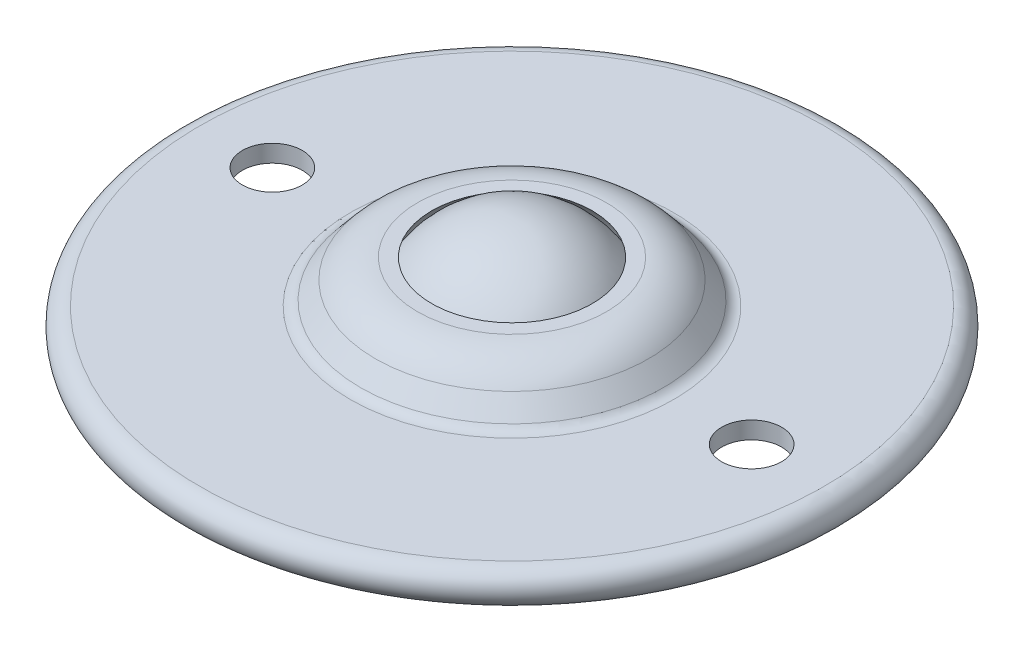
ISO-10303-21;
HEADER;
FILE_DESCRIPTION(('STEP AP214'),'2;1');
FILE_NAME('part.step','',(''),(''),'','','');
FILE_SCHEMA(('AUTOMOTIVE_DESIGN { 1 0 10303 214 1 1 1 1 }'));
ENDSEC;
DATA;
#1=APPLICATION_CONTEXT('core data for automotive mechanical design processes');
#2=APPLICATION_PROTOCOL_DEFINITION('international standard','automotive_design',2000,#1);
#3=PRODUCT_CONTEXT('',#1,'mechanical');
#4=PRODUCT('Part','Part','',(#3));
#5=PRODUCT_RELATED_PRODUCT_CATEGORY('part','',(#4));
#6=PRODUCT_DEFINITION_FORMATION('','',#4);
#7=PRODUCT_DEFINITION_CONTEXT('part definition',#1,'design');
#8=PRODUCT_DEFINITION('design','',#6,#7);
#9=PRODUCT_DEFINITION_SHAPE('','',#8);
#10=(LENGTH_UNIT() NAMED_UNIT(*) SI_UNIT(.MILLI.,.METRE.));
#11=(NAMED_UNIT(*) PLANE_ANGLE_UNIT() SI_UNIT($,.RADIAN.));
#12=(NAMED_UNIT(*) SI_UNIT($,.STERADIAN.) SOLID_ANGLE_UNIT());
#13=UNCERTAINTY_MEASURE_WITH_UNIT(LENGTH_MEASURE(1.E-05),#10,'distance_accuracy_value','');
#14=(GEOMETRIC_REPRESENTATION_CONTEXT(3) GLOBAL_UNCERTAINTY_ASSIGNED_CONTEXT((#13)) GLOBAL_UNIT_ASSIGNED_CONTEXT((#10,
#11,#12)) REPRESENTATION_CONTEXT('',''));
#15=CARTESIAN_POINT('',(0.,0.,0.));
#16=DIRECTION('',(0.,0.,1.));
#17=DIRECTION('',(1.,0.,0.));
#18=AXIS2_PLACEMENT_3D('',#15,#16,#17);
#19=CARTESIAN_POINT('',(0.,0.,0.));
#20=DIRECTION('',(0.,1.,0.));
#21=DIRECTION('',(-1.,0.,0.));
#22=AXIS2_PLACEMENT_3D('',#19,#20,#21);
#23=SPHERICAL_SURFACE('',#22,9.525);
#24=CARTESIAN_POINT('',(0.,9.525,0.));
#25=VERTEX_POINT('',#24);
#26=VERTEX_LOOP('',#25);
#27=FACE_BOUND('',#26,.T.);
#28=ADVANCED_FACE('F45',(#27),#23,.T.);
#29=CLOSED_SHELL('',(#28));
#30=MANIFOLD_SOLID_BREP('B2',#29);
#31=CARTESIAN_POINT('',(-22.225,-12.7,0.));
#32=DIRECTION('',(0.,1.,0.));
#33=DIRECTION('',(0.,0.,1.));
#34=AXIS2_PLACEMENT_3D('',#31,#32,#33);
#35=CYLINDRICAL_SURFACE('',#34,2.778125);
#36=CARTESIAN_POINT('',(-22.225,2.40625,0.));
#37=DIRECTION('',(0.,1.,0.));
#38=DIRECTION('',(0.,0.,1.));
#39=AXIS2_PLACEMENT_3D('',#36,#37,#38);
#40=CIRCLE('',#39,2.778125);
#41=CARTESIAN_POINT('',(-22.225,2.40625,2.778125));
#42=VERTEX_POINT('',#41);
#43=EDGE_CURVE('E93',#42,#42,#40,.T.);
#44=CARTESIAN_POINT('',(-22.225,0.80625,0.));
#45=DIRECTION('',(0.,-1.,0.));
#46=DIRECTION('',(0.,0.,-1.));
#47=AXIS2_PLACEMENT_3D('',#44,#45,#46);
#48=CIRCLE('',#47,2.778125);
#49=CARTESIAN_POINT('',(-22.225,0.80625,2.778125));
#50=VERTEX_POINT('',#49);
#51=EDGE_CURVE('E86',#50,#50,#48,.F.);
#52=CARTESIAN_POINT('',(-22.225,2.40625,2.778125));
#53=CARTESIAN_POINT('',(-22.225,2.38958333333333,2.778125));
#54=CARTESIAN_POINT('',(-22.225,2.37291666666667,2.778125));
#55=CARTESIAN_POINT('',(-22.225,2.33958333333333,2.778125));
#56=CARTESIAN_POINT('',(-22.225,2.32291666666667,2.778125));
#57=CARTESIAN_POINT('',(-22.225,2.28958333333333,2.778125));
#58=CARTESIAN_POINT('',(-22.225,2.27291666666667,2.778125));
#59=CARTESIAN_POINT('',(-22.225,2.23958333333333,2.778125));
#60=CARTESIAN_POINT('',(-22.225,2.22291666666667,2.778125));
#61=CARTESIAN_POINT('',(-22.225,2.18958333333333,2.778125));
#62=CARTESIAN_POINT('',(-22.225,2.17291666666667,2.778125));
#63=CARTESIAN_POINT('',(-22.225,2.13958333333333,2.778125));
#64=CARTESIAN_POINT('',(-22.225,2.12291666666667,2.778125));
#65=CARTESIAN_POINT('',(-22.225,2.08958333333333,2.778125));
#66=CARTESIAN_POINT('',(-22.225,2.07291666666667,2.778125));
#67=CARTESIAN_POINT('',(-22.225,2.03958333333333,2.778125));
#68=CARTESIAN_POINT('',(-22.225,2.02291666666667,2.778125));
#69=CARTESIAN_POINT('',(-22.225,1.98958333333333,2.778125));
#70=CARTESIAN_POINT('',(-22.225,1.97291666666667,2.778125));
#71=CARTESIAN_POINT('',(-22.225,1.93958333333333,2.778125));
#72=CARTESIAN_POINT('',(-22.225,1.92291666666667,2.778125));
#73=CARTESIAN_POINT('',(-22.225,1.88958333333333,2.778125));
#74=CARTESIAN_POINT('',(-22.225,1.87291666666667,2.778125));
#75=CARTESIAN_POINT('',(-22.225,1.83958333333333,2.778125));
#76=CARTESIAN_POINT('',(-22.225,1.82291666666667,2.778125));
#77=CARTESIAN_POINT('',(-22.225,1.78958333333333,2.778125));
#78=CARTESIAN_POINT('',(-22.225,1.77291666666667,2.778125));
#79=CARTESIAN_POINT('',(-22.225,1.73958333333333,2.778125));
#80=CARTESIAN_POINT('',(-22.225,1.72291666666667,2.778125));
#81=CARTESIAN_POINT('',(-22.225,1.68958333333333,2.778125));
#82=CARTESIAN_POINT('',(-22.225,1.67291666666667,2.778125));
#83=CARTESIAN_POINT('',(-22.225,1.63958333333333,2.778125));
#84=CARTESIAN_POINT('',(-22.225,1.62291666666667,2.778125));
#85=CARTESIAN_POINT('',(-22.225,1.58958333333333,2.778125));
#86=CARTESIAN_POINT('',(-22.225,1.57291666666667,2.778125));
#87=CARTESIAN_POINT('',(-22.225,1.53958333333333,2.778125));
#88=CARTESIAN_POINT('',(-22.225,1.52291666666667,2.778125));
#89=CARTESIAN_POINT('',(-22.225,1.48958333333333,2.778125));
#90=CARTESIAN_POINT('',(-22.225,1.47291666666667,2.778125));
#91=CARTESIAN_POINT('',(-22.225,1.43958333333333,2.778125));
#92=CARTESIAN_POINT('',(-22.225,1.42291666666667,2.778125));
#93=CARTESIAN_POINT('',(-22.225,1.38958333333333,2.778125));
#94=CARTESIAN_POINT('',(-22.225,1.37291666666667,2.778125));
#95=CARTESIAN_POINT('',(-22.225,1.33958333333333,2.778125));
#96=CARTESIAN_POINT('',(-22.225,1.32291666666667,2.778125));
#97=CARTESIAN_POINT('',(-22.225,1.28958333333333,2.778125));
#98=CARTESIAN_POINT('',(-22.225,1.27291666666667,2.778125));
#99=CARTESIAN_POINT('',(-22.225,1.23958333333333,2.778125));
#100=CARTESIAN_POINT('',(-22.225,1.22291666666667,2.778125));
#101=CARTESIAN_POINT('',(-22.225,1.18958333333333,2.778125));
#102=CARTESIAN_POINT('',(-22.225,1.17291666666667,2.778125));
#103=CARTESIAN_POINT('',(-22.225,1.13958333333333,2.778125));
#104=CARTESIAN_POINT('',(-22.225,1.12291666666667,2.778125));
#105=CARTESIAN_POINT('',(-22.225,1.08958333333333,2.778125));
#106=CARTESIAN_POINT('',(-22.225,1.07291666666667,2.778125));
#107=CARTESIAN_POINT('',(-22.225,1.03958333333333,2.778125));
#108=CARTESIAN_POINT('',(-22.225,1.02291666666667,2.778125));
#109=CARTESIAN_POINT('',(-22.225,0.989583333333334,2.778125));
#110=CARTESIAN_POINT('',(-22.225,0.972916666666667,2.778125));
#111=CARTESIAN_POINT('',(-22.225,0.939583333333333,2.778125));
#112=CARTESIAN_POINT('',(-22.225,0.922916666666666,2.778125));
#113=CARTESIAN_POINT('',(-22.225,0.889583333333333,2.778125));
#114=CARTESIAN_POINT('',(-22.225,0.872916666666666,2.778125));
#115=CARTESIAN_POINT('',(-22.225,0.839583333333333,2.778125));
#116=CARTESIAN_POINT('',(-22.225,0.822916666666666,2.778125));
#117=CARTESIAN_POINT('',(-22.225,0.80625,2.778125));
#118=B_SPLINE_CURVE_WITH_KNOTS('',3,(#52,#53,#54,#55,#56,#57,#58,#59,#60,#61,#62,#63,#64,#65,
#66,#67,#68,#69,#70,#71,#72,#73,#74,#75,#76,#77,#78,#79,#80,#81,#82,#83,#84,#85,#86,#87,#88,#89,
#90,#91,#92,#93,#94,#95,#96,#97,#98,#99,#100,#101,#102,#103,#104,#105,#106,#107,#108,#109,#110,
#111,#112,#113,#114,#115,#116,#117),.UNSPECIFIED.,.F.,.F.,(4,2,2,2,2,2,2,2,2,2,2,2,2,2,2,2,2,2,
2,2,2,2,2,2,2,2,2,2,2,2,2,2,4),(0.,0.0499999999999997,0.0999999999999994,0.150000000000001,
0.200000000000001,0.25,0.3,0.35,0.400000000000001,0.450000000000001,0.5,0.55,0.6,0.65,
0.700000000000001,0.750000000000001,0.8,0.85,0.9,0.950000000000001,1.,1.05,1.1,1.15,1.2,1.25,
1.3,1.35,1.4,1.45,1.5,1.55,1.6),.UNSPECIFIED.);
#119=EDGE_CURVE('BSEAM56',#42,#50,#118,.T.);
#120=ORIENTED_EDGE('',*,*,#43,.T.);
#121=ORIENTED_EDGE('',*,*,#51,.F.);
#122=ORIENTED_EDGE('',*,*,#119,.T.);
#123=ORIENTED_EDGE('',*,*,#119,.F.);
#124=EDGE_LOOP('',(#120,#122,#121,#123));
#125=FACE_BOUND('',#124,.T.);
#126=ADVANCED_FACE('F56',(#125),#35,.F.);
#127=CARTESIAN_POINT('',(22.225,-12.7,0.));
#128=DIRECTION('',(0.,1.,0.));
#129=DIRECTION('',(0.,0.,1.));
#130=AXIS2_PLACEMENT_3D('',#127,#128,#129);
#131=CYLINDRICAL_SURFACE('',#130,2.778125);
#132=CARTESIAN_POINT('',(22.225,2.40625,0.));
#133=DIRECTION('',(0.,1.,0.));
#134=DIRECTION('',(0.,0.,1.));
#135=AXIS2_PLACEMENT_3D('',#132,#133,#134);
#136=CIRCLE('',#135,2.778125);
#137=CARTESIAN_POINT('',(22.225,2.40625,2.778125));
#138=VERTEX_POINT('',#137);
#139=EDGE_CURVE('E96',#138,#138,#136,.T.);
#140=CARTESIAN_POINT('',(22.225,0.80625,0.));
#141=DIRECTION('',(0.,-1.,0.));
#142=DIRECTION('',(0.,0.,-1.));
#143=AXIS2_PLACEMENT_3D('',#140,#141,#142);
#144=CIRCLE('',#143,2.778125);
#145=CARTESIAN_POINT('',(22.225,0.80625,2.778125));
#146=VERTEX_POINT('',#145);
#147=EDGE_CURVE('E83',#146,#146,#144,.F.);
#148=CARTESIAN_POINT('',(22.225,2.40625,2.778125));
#149=CARTESIAN_POINT('',(22.225,2.38958333333333,2.778125));
#150=CARTESIAN_POINT('',(22.225,2.37291666666667,2.778125));
#151=CARTESIAN_POINT('',(22.225,2.33958333333333,2.778125));
#152=CARTESIAN_POINT('',(22.225,2.32291666666667,2.778125));
#153=CARTESIAN_POINT('',(22.225,2.28958333333333,2.778125));
#154=CARTESIAN_POINT('',(22.225,2.27291666666667,2.778125));
#155=CARTESIAN_POINT('',(22.225,2.23958333333333,2.778125));
#156=CARTESIAN_POINT('',(22.225,2.22291666666667,2.778125));
#157=CARTESIAN_POINT('',(22.225,2.18958333333333,2.778125));
#158=CARTESIAN_POINT('',(22.225,2.17291666666667,2.778125));
#159=CARTESIAN_POINT('',(22.225,2.13958333333333,2.778125));
#160=CARTESIAN_POINT('',(22.225,2.12291666666667,2.778125));
#161=CARTESIAN_POINT('',(22.225,2.08958333333333,2.778125));
#162=CARTESIAN_POINT('',(22.225,2.07291666666667,2.778125));
#163=CARTESIAN_POINT('',(22.225,2.03958333333333,2.778125));
#164=CARTESIAN_POINT('',(22.225,2.02291666666667,2.778125));
#165=CARTESIAN_POINT('',(22.225,1.98958333333333,2.778125));
#166=CARTESIAN_POINT('',(22.225,1.97291666666667,2.778125));
#167=CARTESIAN_POINT('',(22.225,1.93958333333333,2.778125));
#168=CARTESIAN_POINT('',(22.225,1.92291666666667,2.778125));
#169=CARTESIAN_POINT('',(22.225,1.88958333333333,2.778125));
#170=CARTESIAN_POINT('',(22.225,1.87291666666667,2.778125));
#171=CARTESIAN_POINT('',(22.225,1.83958333333333,2.778125));
#172=CARTESIAN_POINT('',(22.225,1.82291666666667,2.778125));
#173=CARTESIAN_POINT('',(22.225,1.78958333333333,2.778125));
#174=CARTESIAN_POINT('',(22.225,1.77291666666667,2.778125));
#175=CARTESIAN_POINT('',(22.225,1.73958333333333,2.778125));
#176=CARTESIAN_POINT('',(22.225,1.72291666666667,2.778125));
#177=CARTESIAN_POINT('',(22.225,1.68958333333333,2.778125));
#178=CARTESIAN_POINT('',(22.225,1.67291666666667,2.778125));
#179=CARTESIAN_POINT('',(22.225,1.63958333333333,2.778125));
#180=CARTESIAN_POINT('',(22.225,1.62291666666667,2.778125));
#181=CARTESIAN_POINT('',(22.225,1.58958333333333,2.778125));
#182=CARTESIAN_POINT('',(22.225,1.57291666666667,2.778125));
#183=CARTESIAN_POINT('',(22.225,1.53958333333333,2.778125));
#184=CARTESIAN_POINT('',(22.225,1.52291666666667,2.778125));
#185=CARTESIAN_POINT('',(22.225,1.48958333333333,2.778125));
#186=CARTESIAN_POINT('',(22.225,1.47291666666667,2.778125));
#187=CARTESIAN_POINT('',(22.225,1.43958333333333,2.778125));
#188=CARTESIAN_POINT('',(22.225,1.42291666666667,2.778125));
#189=CARTESIAN_POINT('',(22.225,1.38958333333333,2.778125));
#190=CARTESIAN_POINT('',(22.225,1.37291666666667,2.778125));
#191=CARTESIAN_POINT('',(22.225,1.33958333333333,2.778125));
#192=CARTESIAN_POINT('',(22.225,1.32291666666667,2.778125));
#193=CARTESIAN_POINT('',(22.225,1.28958333333333,2.778125));
#194=CARTESIAN_POINT('',(22.225,1.27291666666667,2.778125));
#195=CARTESIAN_POINT('',(22.225,1.23958333333333,2.778125));
#196=CARTESIAN_POINT('',(22.225,1.22291666666667,2.778125));
#197=CARTESIAN_POINT('',(22.225,1.18958333333333,2.778125));
#198=CARTESIAN_POINT('',(22.225,1.17291666666667,2.778125));
#199=CARTESIAN_POINT('',(22.225,1.13958333333333,2.778125));
#200=CARTESIAN_POINT('',(22.225,1.12291666666667,2.778125));
#201=CARTESIAN_POINT('',(22.225,1.08958333333333,2.778125));
#202=CARTESIAN_POINT('',(22.225,1.07291666666667,2.778125));
#203=CARTESIAN_POINT('',(22.225,1.03958333333333,2.778125));
#204=CARTESIAN_POINT('',(22.225,1.02291666666667,2.778125));
#205=CARTESIAN_POINT('',(22.225,0.989583333333334,2.778125));
#206=CARTESIAN_POINT('',(22.225,0.972916666666667,2.778125));
#207=CARTESIAN_POINT('',(22.225,0.939583333333333,2.778125));
#208=CARTESIAN_POINT('',(22.225,0.922916666666666,2.778125));
#209=CARTESIAN_POINT('',(22.225,0.889583333333333,2.778125));
#210=CARTESIAN_POINT('',(22.225,0.872916666666666,2.778125));
#211=CARTESIAN_POINT('',(22.225,0.839583333333333,2.778125));
#212=CARTESIAN_POINT('',(22.225,0.822916666666666,2.778125));
#213=CARTESIAN_POINT('',(22.225,0.80625,2.778125));
#214=B_SPLINE_CURVE_WITH_KNOTS('',3,(#148,#149,#150,#151,#152,#153,#154,#155,#156,#157,#158,
#159,#160,#161,#162,#163,#164,#165,#166,#167,#168,#169,#170,#171,#172,#173,#174,#175,#176,#177,
#178,#179,#180,#181,#182,#183,#184,#185,#186,#187,#188,#189,#190,#191,#192,#193,#194,#195,#196,
#197,#198,#199,#200,#201,#202,#203,#204,#205,#206,#207,#208,#209,#210,#211,#212,#213),
.UNSPECIFIED.,.F.,.F.,(4,2,2,2,2,2,2,2,2,2,2,2,2,2,2,2,2,2,2,2,2,2,2,2,2,2,2,2,2,2,2,2,4),(0.,
0.0499999999999997,0.0999999999999994,0.150000000000001,0.200000000000001,0.25,0.3,0.35,
0.400000000000001,0.450000000000001,0.5,0.55,0.6,0.65,0.700000000000001,0.750000000000001,0.8,
0.85,0.9,0.950000000000001,1.,1.05,1.1,1.15,1.2,1.25,1.3,1.35,1.4,1.45,1.5,1.55,1.6),.UNSPECIFIED.);
#215=EDGE_CURVE('BSEAM119',#138,#146,#214,.T.);
#216=ORIENTED_EDGE('',*,*,#139,.T.);
#217=ORIENTED_EDGE('',*,*,#147,.F.);
#218=ORIENTED_EDGE('',*,*,#215,.T.);
#219=ORIENTED_EDGE('',*,*,#215,.F.);
#220=EDGE_LOOP('',(#216,#218,#217,#219));
#221=FACE_BOUND('',#220,.T.);
#222=ADVANCED_FACE('F119',(#221),#131,.F.);
#223=CARTESIAN_POINT('',(0.,2.40625,0.));
#224=DIRECTION('',(0.,-1.,0.));
#225=DIRECTION('',(0.,0.,-1.));
#226=AXIS2_PLACEMENT_3D('',#223,#224,#225);
#227=CONICAL_SURFACE('',#226,14.4145928993037,0.694731219291817);
#228=CARTESIAN_POINT('',(0.,2.86322269745227,0.));
#229=DIRECTION('',(0.,-1.,0.));
#230=DIRECTION('',(0.,0.,-1.));
#231=AXIS2_PLACEMENT_3D('',#228,#229,#230);
#232=CIRCLE('',#231,14.0337877823276);
#233=CARTESIAN_POINT('',(0.,2.86322269745227,-14.0337877823276));
#234=VERTEX_POINT('',#233);
#235=EDGE_CURVE('E44',#234,#234,#232,.F.);
#236=ORIENTED_EDGE('',*,*,#235,.T.);
#237=EDGE_LOOP('',(#236));
#238=FACE_BOUND('',#237,.T.);
#239=CARTESIAN_POINT('',(0.,4.50210921019091,0.));
#240=DIRECTION('',(0.,1.,0.));
#241=DIRECTION('',(0.,0.,1.));
#242=AXIS2_PLACEMENT_3D('',#239,#240,#241);
#243=CIRCLE('',#242,12.6680686186368);
#244=CARTESIAN_POINT('',(0.,4.50210921019091,12.6680686186368));
#245=VERTEX_POINT('',#244);
#246=EDGE_CURVE('E79',#245,#245,#243,.F.);
#247=ORIENTED_EDGE('',*,*,#246,.T.);
#248=EDGE_LOOP('',(#247));
#249=FACE_BOUND('',#248,.T.);
#250=ADVANCED_FACE('F126',(#238,#249),#227,.T.);
#251=CARTESIAN_POINT('',(-14.4145928993037,2.40625,-1.00656564229879E-13));
#252=DIRECTION('',(0.,1.,0.));
#253=DIRECTION('',(0.,0.,1.));
#254=AXIS2_PLACEMENT_3D('',#251,#252,#253);
#255=PLANE('',#254);
#256=CARTESIAN_POINT('',(0.,2.40625,0.));
#257=DIRECTION('',(0.,1.,0.));
#258=DIRECTION('',(0.,0.,1.));
#259=AXIS2_PLACEMENT_3D('',#256,#257,#258);
#260=CIRCLE('',#259,15.0094345448969);
#261=CARTESIAN_POINT('',(0.,2.40625,15.0094345448969));
#262=VERTEX_POINT('',#261);
#263=EDGE_CURVE('E63',#262,#262,#260,.F.);
#264=ORIENTED_EDGE('',*,*,#263,.T.);
#265=EDGE_LOOP('',(#264));
#266=FACE_BOUND('',#265,.T.);
#267=ORIENTED_EDGE('',*,*,#139,.F.);
#268=EDGE_LOOP('',(#267));
#269=FACE_BOUND('',#268,.T.);
#270=ORIENTED_EDGE('',*,*,#43,.F.);
#271=EDGE_LOOP('',(#270));
#272=FACE_BOUND('',#271,.T.);
#273=CARTESIAN_POINT('',(0.,2.40625,0.));
#274=DIRECTION('',(0.,-1.,0.));
#275=DIRECTION('',(0.,0.,-1.));
#276=AXIS2_PLACEMENT_3D('',#273,#274,#275);
#277=CIRCLE('',#276,28.959375);
#278=CARTESIAN_POINT('',(0.,2.40625,-28.959375));
#279=VERTEX_POINT('',#278);
#280=EDGE_CURVE('E82',#279,#279,#277,.T.);
#281=ORIENTED_EDGE('',*,*,#280,.F.);
#282=EDGE_LOOP('',(#281));
#283=FACE_BOUND('',#282,.T.);
#284=ADVANCED_FACE('F145',(#266,#269,#272,#283),#255,.T.);
#285=CARTESIAN_POINT('',(0.,0.80625,0.));
#286=DIRECTION('',(0.,-1.,0.));
#287=DIRECTION('',(0.,0.,-1.));
#288=AXIS2_PLACEMENT_3D('',#285,#286,#287);
#289=TOROIDAL_SURFACE('',#288,28.959375,1.6);
#290=ORIENTED_EDGE('',*,*,#280,.T.);
#291=EDGE_LOOP('',(#290));
#292=FACE_BOUND('',#291,.T.);
#293=CARTESIAN_POINT('',(0.,-0.793749999999999,0.));
#294=DIRECTION('',(0.,1.,0.));
#295=DIRECTION('',(0.,0.,1.));
#296=AXIS2_PLACEMENT_3D('',#293,#294,#295);
#297=CIRCLE('',#296,28.959375);
#298=CARTESIAN_POINT('',(0.,-0.793749999999999,28.959375));
#299=VERTEX_POINT('',#298);
#300=EDGE_CURVE('E87',#299,#299,#297,.T.);
#301=ORIENTED_EDGE('',*,*,#300,.T.);
#302=EDGE_LOOP('',(#301));
#303=FACE_BOUND('',#302,.T.);
#304=ADVANCED_FACE('F136',(#292,#303),#289,.T.);
#305=CARTESIAN_POINT('',(0.,0.,0.));
#306=DIRECTION('',(0.,-1.,0.));
#307=DIRECTION('',(-1.,0.,0.));
#308=AXIS2_PLACEMENT_3D('',#305,#306,#307);
#309=SPHERICAL_SURFACE('',#308,9.779);
#310=CARTESIAN_POINT('',(0.,6.33,0.));
#311=DIRECTION('',(0.,-1.,0.));
#312=DIRECTION('',(0.,0.,-1.));
#313=AXIS2_PLACEMENT_3D('',#310,#311,#312);
#314=CIRCLE('',#313,7.45385410375062);
#315=CARTESIAN_POINT('',(0.,6.33,-7.45385410375062));
#316=VERTEX_POINT('',#315);
#317=EDGE_CURVE('E90',#316,#316,#314,.T.);
#318=ORIENTED_EDGE('',*,*,#317,.F.);
#319=EDGE_LOOP('',(#318));
#320=FACE_BOUND('',#319,.T.);
#321=ADVANCED_FACE('F133',(#320),#309,.F.);
#322=CARTESIAN_POINT('',(-7.45385410375062,6.33,0.));
#323=DIRECTION('',(0.,1.,0.));
#324=DIRECTION('',(0.,0.,1.));
#325=AXIS2_PLACEMENT_3D('',#322,#323,#324);
#326=PLANE('',#325);
#327=CARTESIAN_POINT('',(0.,6.33,0.));
#328=DIRECTION('',(0.,1.,0.));
#329=DIRECTION('',(0.,0.,1.));
#330=AXIS2_PLACEMENT_3D('',#327,#328,#329);
#331=CIRCLE('',#330,8.7654815683596);
#332=CARTESIAN_POINT('',(0.,6.33,8.7654815683596));
#333=VERTEX_POINT('',#332);
#334=EDGE_CURVE('E76',#333,#333,#331,.T.);
#335=ORIENTED_EDGE('',*,*,#334,.T.);
#336=EDGE_LOOP('',(#335));
#337=FACE_BOUND('',#336,.T.);
#338=ORIENTED_EDGE('',*,*,#317,.T.);
#339=EDGE_LOOP('',(#338));
#340=FACE_BOUND('',#339,.T.);
#341=ADVANCED_FACE('F113',(#337,#340),#326,.T.);
#342=CARTESIAN_POINT('',(-15.3752648181801,0.80625,1.07364900384894E-13));
#343=DIRECTION('',(0.,-1.,0.));
#344=DIRECTION('',(0.,0.,-1.));
#345=AXIS2_PLACEMENT_3D('',#342,#343,#344);
#346=PLANE('',#345);
#347=CARTESIAN_POINT('',(0.,0.80625,0.));
#348=DIRECTION('',(0.,-1.,0.));
#349=DIRECTION('',(0.,0.,-1.));
#350=AXIS2_PLACEMENT_3D('',#347,#348,#349);
#351=CIRCLE('',#350,16.4531043645012);
#352=CARTESIAN_POINT('',(0.,0.80625,-16.4531043645012));
#353=VERTEX_POINT('',#352);
#354=EDGE_CURVE('E71',#353,#353,#351,.F.);
#355=ORIENTED_EDGE('',*,*,#354,.T.);
#356=EDGE_LOOP('',(#355));
#357=FACE_BOUND('',#356,.T.);
#358=ORIENTED_EDGE('',*,*,#147,.T.);
#359=EDGE_LOOP('',(#358));
#360=FACE_BOUND('',#359,.T.);
#361=CARTESIAN_POINT('',(0.,0.806250000000001,0.));
#362=DIRECTION('',(0.,1.,0.));
#363=DIRECTION('',(0.,0.,1.));
#364=AXIS2_PLACEMENT_3D('',#361,#362,#363);
#365=CIRCLE('',#364,28.959375);
#366=CARTESIAN_POINT('',(0.,0.806250000000001,28.959375));
#367=VERTEX_POINT('',#366);
#368=EDGE_CURVE('E103',#367,#367,#365,.T.);
#369=ORIENTED_EDGE('',*,*,#368,.F.);
#370=EDGE_LOOP('',(#369));
#371=FACE_BOUND('',#370,.T.);
#372=ORIENTED_EDGE('',*,*,#51,.T.);
#373=EDGE_LOOP('',(#372));
#374=FACE_BOUND('',#373,.T.);
#375=ADVANCED_FACE('F110',(#357,#360,#371,#374),#346,.T.);
#376=CARTESIAN_POINT('',(0.,18.1050860338203,0.));
#377=DIRECTION('',(0.,1.,0.));
#378=DIRECTION('',(0.,0.,1.));
#379=AXIS2_PLACEMENT_3D('',#376,#377,#378);
#380=CYLINDRICAL_SURFACE('',#379,28.959375);
#381=ORIENTED_EDGE('',*,*,#368,.T.);
#382=EDGE_LOOP('',(#381));
#383=FACE_BOUND('',#382,.T.);
#384=ORIENTED_EDGE('',*,*,#300,.F.);
#385=EDGE_LOOP('',(#384));
#386=FACE_BOUND('',#385,.T.);
#387=ADVANCED_FACE('F107',(#383,#386),#380,.F.);
#388=CARTESIAN_POINT('',(0.,2.80458333333334,0.));
#389=DIRECTION('',(0.,-1.,0.));
#390=DIRECTION('',(1.,0.,0.));
#391=AXIS2_PLACEMENT_3D('',#388,#389,#390);
#392=SPHERICAL_SURFACE('',#391,15.5045833333333);
#393=CARTESIAN_POINT('',(0.,-0.216305205047318,0.));
#394=DIRECTION('',(0.,1.,0.));
#395=DIRECTION('',(0.,0.,1.));
#396=AXIS2_PLACEMENT_3D('',#393,#394,#395);
#397=CIRCLE('',#396,15.2074434662424);
#398=CARTESIAN_POINT('',(0.,-0.216305205047318,15.2074434662424));
#399=VERTEX_POINT('',#398);
#400=EDGE_CURVE('E67',#399,#399,#397,.F.);
#401=ORIENTED_EDGE('',*,*,#400,.T.);
#402=EDGE_LOOP('',(#401));
#403=FACE_BOUND('',#402,.T.);
#404=ADVANCED_FACE('F138',(#403),#392,.T.);
#405=CARTESIAN_POINT('',(0.,1.25,0.));
#406=DIRECTION('',(0.,1.,0.));
#407=DIRECTION('',(0.,0.,1.));
#408=AXIS2_PLACEMENT_3D('',#405,#406,#407);
#409=TOROIDAL_SURFACE('',#408,8.7654815683596,5.08);
#410=ORIENTED_EDGE('',*,*,#334,.F.);
#411=EDGE_LOOP('',(#410));
#412=FACE_BOUND('',#411,.T.);
#413=ORIENTED_EDGE('',*,*,#246,.F.);
#414=EDGE_LOOP('',(#413));
#415=FACE_BOUND('',#414,.T.);
#416=ADVANCED_FACE('F141',(#412,#415),#409,.T.);
#417=CARTESIAN_POINT('',(0.,-0.46375,0.));
#418=DIRECTION('',(0.,-1.,0.));
#419=DIRECTION('',(0.,0.,-1.));
#420=AXIS2_PLACEMENT_3D('',#417,#418,#419);
#421=TOROIDAL_SURFACE('',#420,16.4531043645012,1.27);
#422=ORIENTED_EDGE('',*,*,#400,.F.);
#423=EDGE_LOOP('',(#422));
#424=FACE_BOUND('',#423,.T.);
#425=ORIENTED_EDGE('',*,*,#354,.F.);
#426=EDGE_LOOP('',(#425));
#427=FACE_BOUND('',#426,.T.);
#428=ADVANCED_FACE('F152',(#424,#427),#421,.F.);
#429=CARTESIAN_POINT('',(0.,3.67625,0.));
#430=DIRECTION('',(0.,1.,0.));
#431=DIRECTION('',(0.,0.,1.));
#432=AXIS2_PLACEMENT_3D('',#429,#430,#431);
#433=TOROIDAL_SURFACE('',#432,15.0094345448969,1.27);
#434=ORIENTED_EDGE('',*,*,#235,.F.);
#435=EDGE_LOOP('',(#434));
#436=FACE_BOUND('',#435,.T.);
#437=ORIENTED_EDGE('',*,*,#263,.F.);
#438=EDGE_LOOP('',(#437));
#439=FACE_BOUND('',#438,.T.);
#440=ADVANCED_FACE('F58',(#436,#439),#433,.F.);
#441=CLOSED_SHELL('',(#126,#222,#250,#284,#304,#321,#341,#375,#387,#404,#416,#428,#440));
#442=MANIFOLD_SOLID_BREP('B6',#441);
#443=ADVANCED_BREP_SHAPE_REPRESENTATION('',(#18,#30,#442),#14);
#444=SHAPE_DEFINITION_REPRESENTATION(#9,#443);
ENDSEC;
END-ISO-10303-21;
